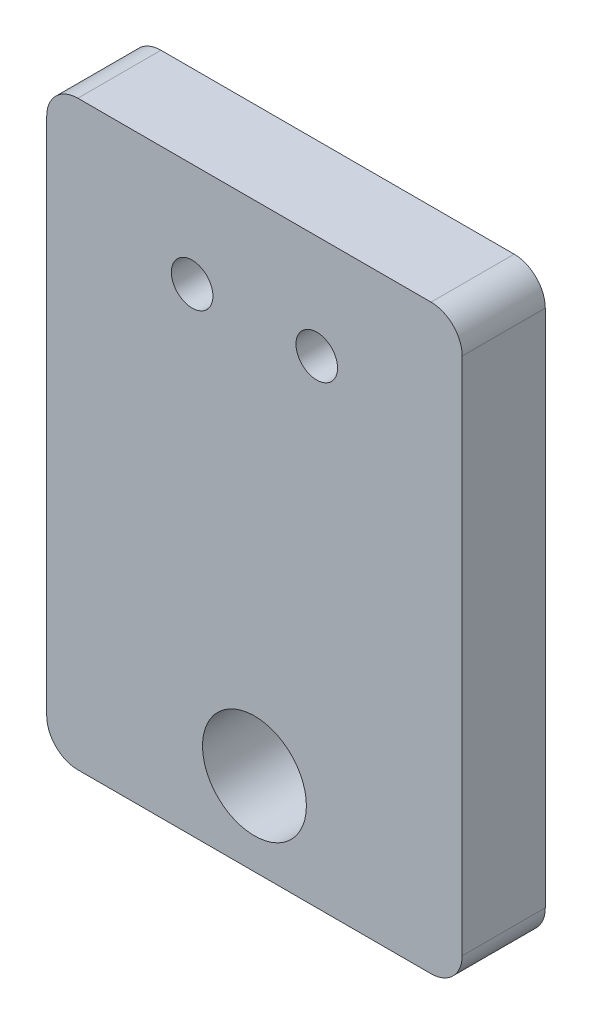
ISO-10303-21;
HEADER;
FILE_DESCRIPTION(('STEP AP214'),'2;1');
FILE_NAME('part.step','',(''),(''),'','','');
FILE_SCHEMA(('AUTOMOTIVE_DESIGN { 1 0 10303 214 1 1 1 1 }'));
ENDSEC;
DATA;
#1=APPLICATION_CONTEXT('core data for automotive mechanical design processes');
#2=APPLICATION_PROTOCOL_DEFINITION('international standard','automotive_design',2000,#1);
#3=PRODUCT_CONTEXT('',#1,'mechanical');
#4=PRODUCT('Part','Part','',(#3));
#5=PRODUCT_RELATED_PRODUCT_CATEGORY('part','',(#4));
#6=PRODUCT_DEFINITION_FORMATION('','',#4);
#7=PRODUCT_DEFINITION_CONTEXT('part definition',#1,'design');
#8=PRODUCT_DEFINITION('design','',#6,#7);
#9=PRODUCT_DEFINITION_SHAPE('','',#8);
#10=(LENGTH_UNIT() NAMED_UNIT(*) SI_UNIT(.MILLI.,.METRE.));
#11=(NAMED_UNIT(*) PLANE_ANGLE_UNIT() SI_UNIT($,.RADIAN.));
#12=(NAMED_UNIT(*) SI_UNIT($,.STERADIAN.) SOLID_ANGLE_UNIT());
#13=UNCERTAINTY_MEASURE_WITH_UNIT(LENGTH_MEASURE(1.E-05),#10,'distance_accuracy_value','');
#14=(GEOMETRIC_REPRESENTATION_CONTEXT(3) GLOBAL_UNCERTAINTY_ASSIGNED_CONTEXT((#13)) GLOBAL_UNIT_ASSIGNED_CONTEXT((#10,
#11,#12)) REPRESENTATION_CONTEXT('',''));
#15=CARTESIAN_POINT('',(0.,0.,0.));
#16=DIRECTION('',(0.,0.,1.));
#17=DIRECTION('',(1.,0.,0.));
#18=AXIS2_PLACEMENT_3D('',#15,#16,#17);
#19=CARTESIAN_POINT('',(-8.5,-12.5,4.));
#20=DIRECTION('',(0.,0.,1.));
#21=DIRECTION('',(1.,0.,0.));
#22=AXIS2_PLACEMENT_3D('',#19,#20,#21);
#23=PLANE('',#22);
#24=CARTESIAN_POINT('',(-3.,9.,4.));
#25=DIRECTION('',(0.,0.,1.));
#26=DIRECTION('',(1.,0.,0.));
#27=AXIS2_PLACEMENT_3D('',#24,#25,#26);
#28=CIRCLE('',#27,0.999999999999998);
#29=CARTESIAN_POINT('',(-2.,9.,4.));
#30=VERTEX_POINT('',#29);
#31=EDGE_CURVE('E156',#30,#30,#28,.T.);
#32=ORIENTED_EDGE('',*,*,#31,.F.);
#33=EDGE_LOOP('',(#32));
#34=FACE_BOUND('',#33,.T.);
#35=CARTESIAN_POINT('',(-8.5,-12.5,4.));
#36=DIRECTION('',(0.,0.,1.));
#37=DIRECTION('',(1.,0.,0.));
#38=AXIS2_PLACEMENT_3D('',#35,#36,#37);
#39=CIRCLE('',#38,1.5);
#40=CARTESIAN_POINT('',(-10.,-12.5,4.));
#41=VERTEX_POINT('',#40);
#42=CARTESIAN_POINT('',(-8.49999999999999,-14.,4.));
#43=VERTEX_POINT('',#42);
#44=EDGE_CURVE('E181',#41,#43,#39,.T.);
#45=ORIENTED_EDGE('',*,*,#44,.T.);
#46=DIRECTION('',(1.,0.,0.));
#47=VECTOR('',#46,1.);
#48=CARTESIAN_POINT('',(-8.49999999999999,-14.,4.));
#49=LINE('',#48,#47);
#50=CARTESIAN_POINT('',(8.49999999999999,-14.,4.));
#51=VERTEX_POINT('',#50);
#52=EDGE_CURVE('E107',#43,#51,#49,.T.);
#53=ORIENTED_EDGE('',*,*,#52,.T.);
#54=CARTESIAN_POINT('',(8.5,-12.5,4.));
#55=DIRECTION('',(0.,0.,1.));
#56=DIRECTION('',(1.,0.,0.));
#57=AXIS2_PLACEMENT_3D('',#54,#55,#56);
#58=CIRCLE('',#57,1.5);
#59=CARTESIAN_POINT('',(10.,-12.5,4.));
#60=VERTEX_POINT('',#59);
#61=EDGE_CURVE('E187',#51,#60,#58,.T.);
#62=ORIENTED_EDGE('',*,*,#61,.T.);
#63=DIRECTION('',(0.,1.,0.));
#64=VECTOR('',#63,1.);
#65=CARTESIAN_POINT('',(10.,12.5,4.));
#66=LINE('',#65,#64);
#67=CARTESIAN_POINT('',(10.,12.5,4.));
#68=VERTEX_POINT('',#67);
#69=EDGE_CURVE('E191',#60,#68,#66,.T.);
#70=ORIENTED_EDGE('',*,*,#69,.T.);
#71=CARTESIAN_POINT('',(8.5,12.5,4.));
#72=DIRECTION('',(0.,0.,1.));
#73=DIRECTION('',(-1.,0.,0.));
#74=AXIS2_PLACEMENT_3D('',#71,#72,#73);
#75=CIRCLE('',#74,1.5);
#76=CARTESIAN_POINT('',(8.49999999999999,14.,4.));
#77=VERTEX_POINT('',#76);
#78=EDGE_CURVE('E126',#68,#77,#75,.T.);
#79=ORIENTED_EDGE('',*,*,#78,.T.);
#80=DIRECTION('',(-1.,0.,0.));
#81=VECTOR('',#80,1.);
#82=CARTESIAN_POINT('',(-8.49999999999999,14.,4.));
#83=LINE('',#82,#81);
#84=CARTESIAN_POINT('',(-8.49999999999999,14.,4.));
#85=VERTEX_POINT('',#84);
#86=EDGE_CURVE('E120',#77,#85,#83,.T.);
#87=ORIENTED_EDGE('',*,*,#86,.T.);
#88=CARTESIAN_POINT('',(-8.5,12.5,4.));
#89=DIRECTION('',(0.,0.,1.));
#90=DIRECTION('',(1.,0.,0.));
#91=AXIS2_PLACEMENT_3D('',#88,#89,#90);
#92=CIRCLE('',#91,1.5);
#93=CARTESIAN_POINT('',(-10.,12.5,4.));
#94=VERTEX_POINT('',#93);
#95=EDGE_CURVE('E124',#85,#94,#92,.T.);
#96=ORIENTED_EDGE('',*,*,#95,.T.);
#97=DIRECTION('',(0.,-1.,0.));
#98=VECTOR('',#97,1.);
#99=CARTESIAN_POINT('',(-10.,12.5,4.));
#100=LINE('',#99,#98);
#101=EDGE_CURVE('E64',#94,#41,#100,.T.);
#102=ORIENTED_EDGE('',*,*,#101,.T.);
#103=EDGE_LOOP('',(#45,#53,#62,#70,#79,#87,#96,#102));
#104=FACE_BOUND('',#103,.T.);
#105=CARTESIAN_POINT('',(0.,-10.,4.));
#106=DIRECTION('',(0.,0.,1.));
#107=DIRECTION('',(1.,0.,0.));
#108=AXIS2_PLACEMENT_3D('',#105,#106,#107);
#109=CIRCLE('',#108,2.5);
#110=CARTESIAN_POINT('',(2.5,-10.,4.));
#111=VERTEX_POINT('',#110);
#112=EDGE_CURVE('E169',#111,#111,#109,.T.);
#113=ORIENTED_EDGE('',*,*,#112,.F.);
#114=EDGE_LOOP('',(#113));
#115=FACE_BOUND('',#114,.T.);
#116=CARTESIAN_POINT('',(3.,9.,4.));
#117=DIRECTION('',(0.,0.,1.));
#118=DIRECTION('',(-1.,0.,0.));
#119=AXIS2_PLACEMENT_3D('',#116,#117,#118);
#120=CIRCLE('',#119,0.999999999999998);
#121=CARTESIAN_POINT('',(2.,9.,4.));
#122=VERTEX_POINT('',#121);
#123=EDGE_CURVE('E168',#122,#122,#120,.T.);
#124=ORIENTED_EDGE('',*,*,#123,.F.);
#125=EDGE_LOOP('',(#124));
#126=FACE_BOUND('',#125,.T.);
#127=ADVANCED_FACE('F46',(#34,#104,#115,#126),#23,.T.);
#128=CARTESIAN_POINT('',(-8.5,-12.5,0.));
#129=DIRECTION('',(0.,0.,1.));
#130=DIRECTION('',(1.,0.,0.));
#131=AXIS2_PLACEMENT_3D('',#128,#129,#130);
#132=PLANE('',#131);
#133=CARTESIAN_POINT('',(-8.5,-12.5,0.));
#134=DIRECTION('',(0.,0.,1.));
#135=DIRECTION('',(1.,0.,0.));
#136=AXIS2_PLACEMENT_3D('',#133,#134,#135);
#137=CIRCLE('',#136,1.5);
#138=CARTESIAN_POINT('',(-10.,-12.5,0.));
#139=VERTEX_POINT('',#138);
#140=CARTESIAN_POINT('',(-8.49999999999999,-14.,0.));
#141=VERTEX_POINT('',#140);
#142=EDGE_CURVE('E174',#139,#141,#137,.T.);
#143=ORIENTED_EDGE('',*,*,#142,.F.);
#144=DIRECTION('',(0.,-1.,0.));
#145=VECTOR('',#144,1.);
#146=CARTESIAN_POINT('',(-10.,12.5,0.));
#147=LINE('',#146,#145);
#148=CARTESIAN_POINT('',(-10.,12.5,0.));
#149=VERTEX_POINT('',#148);
#150=EDGE_CURVE('E99',#149,#139,#147,.T.);
#151=ORIENTED_EDGE('',*,*,#150,.F.);
#152=CARTESIAN_POINT('',(-8.5,12.5,0.));
#153=DIRECTION('',(0.,0.,1.));
#154=DIRECTION('',(1.,0.,0.));
#155=AXIS2_PLACEMENT_3D('',#152,#153,#154);
#156=CIRCLE('',#155,1.5);
#157=CARTESIAN_POINT('',(-8.49999999999999,14.,0.));
#158=VERTEX_POINT('',#157);
#159=EDGE_CURVE('E93',#158,#149,#156,.T.);
#160=ORIENTED_EDGE('',*,*,#159,.F.);
#161=DIRECTION('',(-1.,0.,0.));
#162=VECTOR('',#161,1.);
#163=CARTESIAN_POINT('',(-8.49999999999999,14.,0.));
#164=LINE('',#163,#162);
#165=CARTESIAN_POINT('',(8.49999999999999,14.,0.));
#166=VERTEX_POINT('',#165);
#167=EDGE_CURVE('E135',#166,#158,#164,.T.);
#168=ORIENTED_EDGE('',*,*,#167,.F.);
#169=CARTESIAN_POINT('',(8.5,12.5,0.));
#170=DIRECTION('',(0.,0.,1.));
#171=DIRECTION('',(-1.,0.,0.));
#172=AXIS2_PLACEMENT_3D('',#169,#170,#171);
#173=CIRCLE('',#172,1.5);
#174=CARTESIAN_POINT('',(10.,12.5,0.));
#175=VERTEX_POINT('',#174);
#176=EDGE_CURVE('E214',#175,#166,#173,.T.);
#177=ORIENTED_EDGE('',*,*,#176,.F.);
#178=DIRECTION('',(0.,1.,0.));
#179=VECTOR('',#178,1.);
#180=CARTESIAN_POINT('',(10.,12.5,0.));
#181=LINE('',#180,#179);
#182=CARTESIAN_POINT('',(10.,-12.5,0.));
#183=VERTEX_POINT('',#182);
#184=EDGE_CURVE('E207',#183,#175,#181,.T.);
#185=ORIENTED_EDGE('',*,*,#184,.F.);
#186=CARTESIAN_POINT('',(8.5,-12.5,0.));
#187=DIRECTION('',(0.,0.,1.));
#188=DIRECTION('',(1.,0.,0.));
#189=AXIS2_PLACEMENT_3D('',#186,#187,#188);
#190=CIRCLE('',#189,1.5);
#191=CARTESIAN_POINT('',(8.49999999999999,-14.,0.));
#192=VERTEX_POINT('',#191);
#193=EDGE_CURVE('E225',#192,#183,#190,.T.);
#194=ORIENTED_EDGE('',*,*,#193,.F.);
#195=DIRECTION('',(1.,0.,0.));
#196=VECTOR('',#195,1.);
#197=CARTESIAN_POINT('',(-8.49999999999999,-14.,0.));
#198=LINE('',#197,#196);
#199=EDGE_CURVE('E231',#141,#192,#198,.T.);
#200=ORIENTED_EDGE('',*,*,#199,.F.);
#201=EDGE_LOOP('',(#143,#151,#160,#168,#177,#185,#194,#200));
#202=FACE_BOUND('',#201,.T.);
#203=CARTESIAN_POINT('',(0.,-10.,0.));
#204=DIRECTION('',(0.,0.,1.));
#205=DIRECTION('',(1.,0.,0.));
#206=AXIS2_PLACEMENT_3D('',#203,#204,#205);
#207=CIRCLE('',#206,2.5);
#208=CARTESIAN_POINT('',(2.5,-10.,0.));
#209=VERTEX_POINT('',#208);
#210=EDGE_CURVE('E162',#209,#209,#207,.T.);
#211=ORIENTED_EDGE('',*,*,#210,.T.);
#212=EDGE_LOOP('',(#211));
#213=FACE_BOUND('',#212,.T.);
#214=CARTESIAN_POINT('',(-3.,9.,0.));
#215=DIRECTION('',(0.,0.,1.));
#216=DIRECTION('',(1.,0.,0.));
#217=AXIS2_PLACEMENT_3D('',#214,#215,#216);
#218=CIRCLE('',#217,0.999999999999998);
#219=CARTESIAN_POINT('',(-2.,9.,0.));
#220=VERTEX_POINT('',#219);
#221=EDGE_CURVE('E163',#220,#220,#218,.T.);
#222=ORIENTED_EDGE('',*,*,#221,.T.);
#223=EDGE_LOOP('',(#222));
#224=FACE_BOUND('',#223,.T.);
#225=CARTESIAN_POINT('',(3.,9.,0.));
#226=DIRECTION('',(0.,0.,1.));
#227=DIRECTION('',(-1.,0.,0.));
#228=AXIS2_PLACEMENT_3D('',#225,#226,#227);
#229=CIRCLE('',#228,0.999999999999998);
#230=CARTESIAN_POINT('',(2.,9.,0.));
#231=VERTEX_POINT('',#230);
#232=EDGE_CURVE('E164',#231,#231,#229,.T.);
#233=ORIENTED_EDGE('',*,*,#232,.T.);
#234=EDGE_LOOP('',(#233));
#235=FACE_BOUND('',#234,.T.);
#236=ADVANCED_FACE('F229',(#202,#213,#224,#235),#132,.F.);
#237=CARTESIAN_POINT('',(-8.5,-12.5,4.));
#238=DIRECTION('',(0.,0.,-1.));
#239=DIRECTION('',(-1.,0.,0.));
#240=AXIS2_PLACEMENT_3D('',#237,#238,#239);
#241=CYLINDRICAL_SURFACE('',#240,1.5);
#242=ORIENTED_EDGE('',*,*,#142,.T.);
#243=DIRECTION('',(0.,0.,-1.));
#244=VECTOR('',#243,1.);
#245=CARTESIAN_POINT('',(-8.49999999999999,-14.,4.));
#246=LINE('',#245,#244);
#247=EDGE_CURVE('E12',#43,#141,#246,.T.);
#248=ORIENTED_EDGE('',*,*,#247,.F.);
#249=ORIENTED_EDGE('',*,*,#44,.F.);
#250=DIRECTION('',(0.,0.,-1.));
#251=VECTOR('',#250,1.);
#252=CARTESIAN_POINT('',(-10.,-12.5,4.));
#253=LINE('',#252,#251);
#254=EDGE_CURVE('E144',#41,#139,#253,.T.);
#255=ORIENTED_EDGE('',*,*,#254,.T.);
#256=EDGE_LOOP('',(#242,#248,#249,#255));
#257=FACE_BOUND('',#256,.T.);
#258=ADVANCED_FACE('F48',(#257),#241,.T.);
#259=CARTESIAN_POINT('',(-8.49999999999999,-14.,4.));
#260=DIRECTION('',(0.,1.,0.));
#261=DIRECTION('',(0.,0.,1.));
#262=AXIS2_PLACEMENT_3D('',#259,#260,#261);
#263=PLANE('',#262);
#264=ORIENTED_EDGE('',*,*,#199,.T.);
#265=DIRECTION('',(0.,0.,-1.));
#266=VECTOR('',#265,1.);
#267=CARTESIAN_POINT('',(8.49999999999999,-14.,4.));
#268=LINE('',#267,#266);
#269=EDGE_CURVE('E56',#51,#192,#268,.T.);
#270=ORIENTED_EDGE('',*,*,#269,.F.);
#271=ORIENTED_EDGE('',*,*,#52,.F.);
#272=ORIENTED_EDGE('',*,*,#247,.T.);
#273=EDGE_LOOP('',(#264,#270,#271,#272));
#274=FACE_BOUND('',#273,.T.);
#275=ADVANCED_FACE('F305',(#274),#263,.F.);
#276=CARTESIAN_POINT('',(8.5,-12.5,4.));
#277=DIRECTION('',(0.,0.,-1.));
#278=DIRECTION('',(-1.,0.,0.));
#279=AXIS2_PLACEMENT_3D('',#276,#277,#278);
#280=CYLINDRICAL_SURFACE('',#279,1.5);
#281=ORIENTED_EDGE('',*,*,#193,.T.);
#282=DIRECTION('',(0.,0.,-1.));
#283=VECTOR('',#282,1.);
#284=CARTESIAN_POINT('',(10.,-12.5,4.));
#285=LINE('',#284,#283);
#286=EDGE_CURVE('E211',#60,#183,#285,.T.);
#287=ORIENTED_EDGE('',*,*,#286,.F.);
#288=ORIENTED_EDGE('',*,*,#61,.F.);
#289=ORIENTED_EDGE('',*,*,#269,.T.);
#290=EDGE_LOOP('',(#281,#287,#288,#289));
#291=FACE_BOUND('',#290,.T.);
#292=ADVANCED_FACE('F224',(#291),#280,.T.);
#293=CARTESIAN_POINT('',(10.,12.5,4.));
#294=DIRECTION('',(-1.,0.,0.));
#295=DIRECTION('',(0.,-1.,0.));
#296=AXIS2_PLACEMENT_3D('',#293,#294,#295);
#297=PLANE('',#296);
#298=ORIENTED_EDGE('',*,*,#184,.T.);
#299=DIRECTION('',(0.,0.,-1.));
#300=VECTOR('',#299,1.);
#301=CARTESIAN_POINT('',(10.,12.5,4.));
#302=LINE('',#301,#300);
#303=EDGE_CURVE('E204',#68,#175,#302,.T.);
#304=ORIENTED_EDGE('',*,*,#303,.F.);
#305=ORIENTED_EDGE('',*,*,#69,.F.);
#306=ORIENTED_EDGE('',*,*,#286,.T.);
#307=EDGE_LOOP('',(#298,#304,#305,#306));
#308=FACE_BOUND('',#307,.T.);
#309=ADVANCED_FACE('F205',(#308),#297,.F.);
#310=CARTESIAN_POINT('',(8.5,12.5,4.));
#311=DIRECTION('',(0.,0.,-1.));
#312=DIRECTION('',(-1.,0.,0.));
#313=AXIS2_PLACEMENT_3D('',#310,#311,#312);
#314=CYLINDRICAL_SURFACE('',#313,1.5);
#315=ORIENTED_EDGE('',*,*,#176,.T.);
#316=DIRECTION('',(0.,0.,-1.));
#317=VECTOR('',#316,1.);
#318=CARTESIAN_POINT('',(8.49999999999999,14.,4.));
#319=LINE('',#318,#317);
#320=EDGE_CURVE('E137',#77,#166,#319,.T.);
#321=ORIENTED_EDGE('',*,*,#320,.F.);
#322=ORIENTED_EDGE('',*,*,#78,.F.);
#323=ORIENTED_EDGE('',*,*,#303,.T.);
#324=EDGE_LOOP('',(#315,#321,#322,#323));
#325=FACE_BOUND('',#324,.T.);
#326=ADVANCED_FACE('F213',(#325),#314,.T.);
#327=CARTESIAN_POINT('',(-8.49999999999999,14.,4.));
#328=DIRECTION('',(0.,-1.,0.));
#329=DIRECTION('',(0.,0.,-1.));
#330=AXIS2_PLACEMENT_3D('',#327,#328,#329);
#331=PLANE('',#330);
#332=ORIENTED_EDGE('',*,*,#167,.T.);
#333=DIRECTION('',(0.,0.,-1.));
#334=VECTOR('',#333,1.);
#335=CARTESIAN_POINT('',(-8.49999999999999,14.,4.));
#336=LINE('',#335,#334);
#337=EDGE_CURVE('E132',#85,#158,#336,.T.);
#338=ORIENTED_EDGE('',*,*,#337,.F.);
#339=ORIENTED_EDGE('',*,*,#86,.F.);
#340=ORIENTED_EDGE('',*,*,#320,.T.);
#341=EDGE_LOOP('',(#332,#338,#339,#340));
#342=FACE_BOUND('',#341,.T.);
#343=ADVANCED_FACE('F133',(#342),#331,.F.);
#344=CARTESIAN_POINT('',(-8.5,12.5,4.));
#345=DIRECTION('',(0.,0.,-1.));
#346=DIRECTION('',(-1.,0.,0.));
#347=AXIS2_PLACEMENT_3D('',#344,#345,#346);
#348=CYLINDRICAL_SURFACE('',#347,1.5);
#349=ORIENTED_EDGE('',*,*,#159,.T.);
#350=DIRECTION('',(0.,0.,-1.));
#351=VECTOR('',#350,1.);
#352=CARTESIAN_POINT('',(-10.,12.5,4.));
#353=LINE('',#352,#351);
#354=EDGE_CURVE('E138',#94,#149,#353,.T.);
#355=ORIENTED_EDGE('',*,*,#354,.F.);
#356=ORIENTED_EDGE('',*,*,#95,.F.);
#357=ORIENTED_EDGE('',*,*,#337,.T.);
#358=EDGE_LOOP('',(#349,#355,#356,#357));
#359=FACE_BOUND('',#358,.T.);
#360=ADVANCED_FACE('F140',(#359),#348,.T.);
#361=CARTESIAN_POINT('',(-10.,12.5,4.));
#362=DIRECTION('',(1.,0.,0.));
#363=DIRECTION('',(0.,1.,0.));
#364=AXIS2_PLACEMENT_3D('',#361,#362,#363);
#365=PLANE('',#364);
#366=ORIENTED_EDGE('',*,*,#150,.T.);
#367=ORIENTED_EDGE('',*,*,#254,.F.);
#368=ORIENTED_EDGE('',*,*,#101,.F.);
#369=ORIENTED_EDGE('',*,*,#354,.T.);
#370=EDGE_LOOP('',(#366,#367,#368,#369));
#371=FACE_BOUND('',#370,.T.);
#372=ADVANCED_FACE('F249',(#371),#365,.F.);
#373=CARTESIAN_POINT('',(0.,-10.,4.));
#374=DIRECTION('',(0.,0.,-1.));
#375=DIRECTION('',(-1.,0.,0.));
#376=AXIS2_PLACEMENT_3D('',#373,#374,#375);
#377=CYLINDRICAL_SURFACE('',#376,2.5);
#378=ORIENTED_EDGE('',*,*,#112,.T.);
#379=EDGE_LOOP('',(#378));
#380=FACE_BOUND('',#379,.T.);
#381=ORIENTED_EDGE('',*,*,#210,.F.);
#382=EDGE_LOOP('',(#381));
#383=FACE_BOUND('',#382,.T.);
#384=ADVANCED_FACE('F280',(#380,#383),#377,.F.);
#385=CARTESIAN_POINT('',(-3.,9.,4.));
#386=DIRECTION('',(0.,0.,-1.));
#387=DIRECTION('',(-1.,0.,0.));
#388=AXIS2_PLACEMENT_3D('',#385,#386,#387);
#389=CYLINDRICAL_SURFACE('',#388,0.999999999999998);
#390=ORIENTED_EDGE('',*,*,#31,.T.);
#391=EDGE_LOOP('',(#390));
#392=FACE_BOUND('',#391,.T.);
#393=ORIENTED_EDGE('',*,*,#221,.F.);
#394=EDGE_LOOP('',(#393));
#395=FACE_BOUND('',#394,.T.);
#396=ADVANCED_FACE('F274',(#392,#395),#389,.F.);
#397=CARTESIAN_POINT('',(3.,9.,4.));
#398=DIRECTION('',(0.,0.,-1.));
#399=DIRECTION('',(-1.,0.,0.));
#400=AXIS2_PLACEMENT_3D('',#397,#398,#399);
#401=CYLINDRICAL_SURFACE('',#400,0.999999999999998);
#402=ORIENTED_EDGE('',*,*,#123,.T.);
#403=EDGE_LOOP('',(#402));
#404=FACE_BOUND('',#403,.T.);
#405=ORIENTED_EDGE('',*,*,#232,.F.);
#406=EDGE_LOOP('',(#405));
#407=FACE_BOUND('',#406,.T.);
#408=ADVANCED_FACE('F272',(#404,#407),#401,.F.);
#409=CLOSED_SHELL('',(#127,#236,#258,#275,#292,#309,#326,#343,#360,#372,#384,#396,#408));
#410=MANIFOLD_SOLID_BREP('B2',#409);
#411=ADVANCED_BREP_SHAPE_REPRESENTATION('',(#18,#410),#14);
#412=SHAPE_DEFINITION_REPRESENTATION(#9,#411);
ENDSEC;
END-ISO-10303-21;
